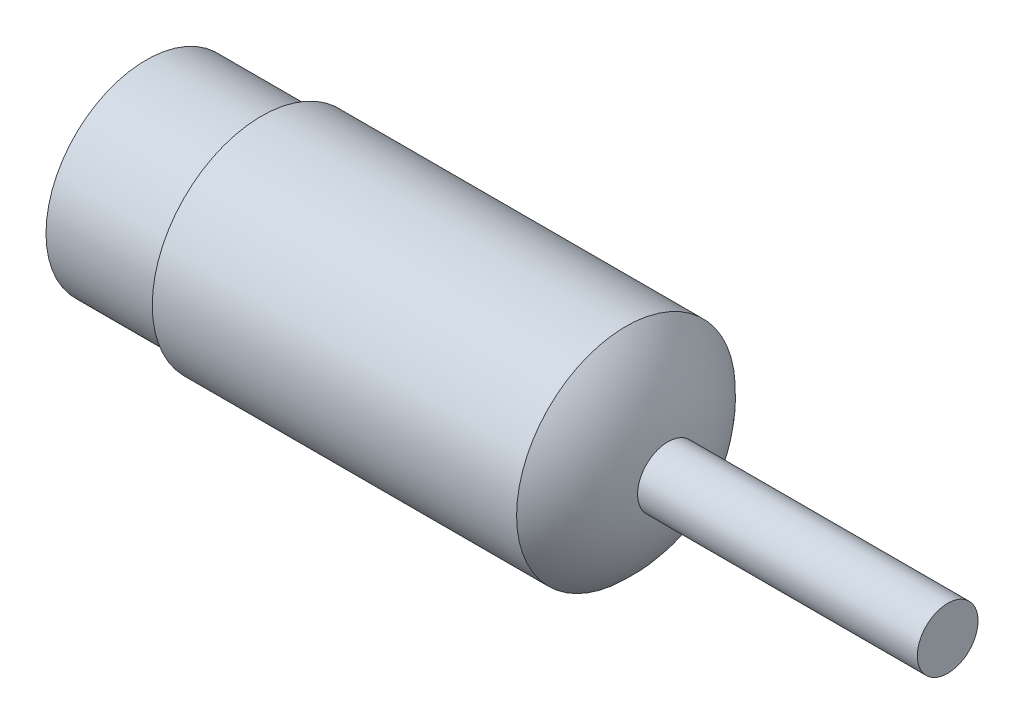
ISO-10303-21;
HEADER;
FILE_DESCRIPTION(('STEP AP214'),'2;1');
FILE_NAME('part.step','',(''),(''),'','','');
FILE_SCHEMA(('AUTOMOTIVE_DESIGN { 1 0 10303 214 1 1 1 1 }'));
ENDSEC;
DATA;
#1=APPLICATION_CONTEXT('core data for automotive mechanical design processes');
#2=APPLICATION_PROTOCOL_DEFINITION('international standard','automotive_design',2000,#1);
#3=PRODUCT_CONTEXT('',#1,'mechanical');
#4=PRODUCT('Part','Part','',(#3));
#5=PRODUCT_RELATED_PRODUCT_CATEGORY('part','',(#4));
#6=PRODUCT_DEFINITION_FORMATION('','',#4);
#7=PRODUCT_DEFINITION_CONTEXT('part definition',#1,'design');
#8=PRODUCT_DEFINITION('design','',#6,#7);
#9=PRODUCT_DEFINITION_SHAPE('','',#8);
#10=(LENGTH_UNIT() NAMED_UNIT(*) SI_UNIT(.MILLI.,.METRE.));
#11=(NAMED_UNIT(*) PLANE_ANGLE_UNIT() SI_UNIT($,.RADIAN.));
#12=(NAMED_UNIT(*) SI_UNIT($,.STERADIAN.) SOLID_ANGLE_UNIT());
#13=UNCERTAINTY_MEASURE_WITH_UNIT(LENGTH_MEASURE(1.E-05),#10,'distance_accuracy_value','');
#14=(GEOMETRIC_REPRESENTATION_CONTEXT(3) GLOBAL_UNCERTAINTY_ASSIGNED_CONTEXT((#13)) GLOBAL_UNIT_ASSIGNED_CONTEXT((#10,
#11,#12)) REPRESENTATION_CONTEXT('',''));
#15=CARTESIAN_POINT('',(0.,0.,0.));
#16=DIRECTION('',(0.,0.,1.));
#17=DIRECTION('',(1.,0.,0.));
#18=AXIS2_PLACEMENT_3D('',#15,#16,#17);
#19=CARTESIAN_POINT('',(0.,0.,0.));
#20=DIRECTION('',(1.,0.,0.));
#21=DIRECTION('',(0.,0.,-1.));
#22=AXIS2_PLACEMENT_3D('',#19,#20,#21);
#23=PLANE('',#22);
#24=CARTESIAN_POINT('',(0.,0.,0.));
#25=DIRECTION('',(-1.,0.,0.));
#26=DIRECTION('',(0.,0.,1.));
#27=AXIS2_PLACEMENT_3D('',#24,#25,#26);
#28=CIRCLE('',#27,8.25);
#29=CARTESIAN_POINT('',(0.,0.,8.25));
#30=VERTEX_POINT('',#29);
#31=EDGE_CURVE('E10',#30,#30,#28,.T.);
#32=ORIENTED_EDGE('',*,*,#31,.T.);
#33=EDGE_LOOP('',(#32));
#34=FACE_BOUND('',#33,.T.);
#35=ADVANCED_FACE('F33',(#34),#23,.F.);
#36=CARTESIAN_POINT('',(0.,0.,0.));
#37=DIRECTION('',(-1.,0.,0.));
#38=DIRECTION('',(0.,0.,1.));
#39=AXIS2_PLACEMENT_3D('',#36,#37,#38);
#40=CYLINDRICAL_SURFACE('',#39,8.25);
#41=ORIENTED_EDGE('',*,*,#31,.F.);
#42=EDGE_LOOP('',(#41));
#43=FACE_BOUND('',#42,.T.);
#44=CARTESIAN_POINT('',(9.5,0.,0.));
#45=DIRECTION('',(-1.,0.,0.));
#46=DIRECTION('',(0.,0.,1.));
#47=AXIS2_PLACEMENT_3D('',#44,#45,#46);
#48=CIRCLE('',#47,8.25);
#49=CARTESIAN_POINT('',(9.5,0.,8.25));
#50=VERTEX_POINT('',#49);
#51=EDGE_CURVE('E40',#50,#50,#48,.T.);
#52=ORIENTED_EDGE('',*,*,#51,.T.);
#53=EDGE_LOOP('',(#52));
#54=FACE_BOUND('',#53,.T.);
#55=ADVANCED_FACE('F75',(#43,#54),#40,.T.);
#56=CARTESIAN_POINT('',(9.5,8.25,0.));
#57=DIRECTION('',(1.,0.,0.));
#58=DIRECTION('',(0.,0.,-1.));
#59=AXIS2_PLACEMENT_3D('',#56,#57,#58);
#60=PLANE('',#59);
#61=ORIENTED_EDGE('',*,*,#51,.F.);
#62=EDGE_LOOP('',(#61));
#63=FACE_BOUND('',#62,.T.);
#64=CARTESIAN_POINT('',(9.5,0.,0.));
#65=DIRECTION('',(-1.,0.,0.));
#66=DIRECTION('',(0.,0.,1.));
#67=AXIS2_PLACEMENT_3D('',#64,#65,#66);
#68=CIRCLE('',#67,9.);
#69=CARTESIAN_POINT('',(9.5,0.,9.));
#70=VERTEX_POINT('',#69);
#71=EDGE_CURVE('E44',#70,#70,#68,.T.);
#72=ORIENTED_EDGE('',*,*,#71,.T.);
#73=EDGE_LOOP('',(#72));
#74=FACE_BOUND('',#73,.T.);
#75=ADVANCED_FACE('F79',(#63,#74),#60,.F.);
#76=CARTESIAN_POINT('',(0.,0.,0.));
#77=DIRECTION('',(-1.,0.,0.));
#78=DIRECTION('',(0.,0.,1.));
#79=AXIS2_PLACEMENT_3D('',#76,#77,#78);
#80=CYLINDRICAL_SURFACE('',#79,9.);
#81=ORIENTED_EDGE('',*,*,#71,.F.);
#82=EDGE_LOOP('',(#81));
#83=FACE_BOUND('',#82,.T.);
#84=CARTESIAN_POINT('',(39.5,0.,0.));
#85=DIRECTION('',(-1.,0.,0.));
#86=DIRECTION('',(0.,0.,1.));
#87=AXIS2_PLACEMENT_3D('',#84,#85,#86);
#88=CIRCLE('',#87,9.);
#89=CARTESIAN_POINT('',(39.5,0.,9.));
#90=VERTEX_POINT('',#89);
#91=EDGE_CURVE('E49',#90,#90,#88,.T.);
#92=ORIENTED_EDGE('',*,*,#91,.T.);
#93=EDGE_LOOP('',(#92));
#94=FACE_BOUND('',#93,.T.);
#95=ADVANCED_FACE('F72',(#83,#94),#80,.T.);
#96=CARTESIAN_POINT('',(32.491464953089,0.,0.));
#97=DIRECTION('',(-1.,0.,0.));
#98=DIRECTION('',(0.,0.,1.));
#99=AXIS2_PLACEMENT_3D('',#96,#97,#98);
#100=DEGENERATE_TOROIDAL_SURFACE('',#99,1.09390303731238,10.5653174437496,.T.);
#101=CARTESIAN_POINT('',(42.9627983934259,0.,0.));
#102=DIRECTION('',(-1.,0.,0.));
#103=DIRECTION('',(0.,0.,1.));
#104=AXIS2_PLACEMENT_3D('',#101,#102,#103);
#105=CIRCLE('',#104,2.5);
#106=CARTESIAN_POINT('',(42.9627983934259,0.,2.5));
#107=VERTEX_POINT('',#106);
#108=EDGE_CURVE('E36',#107,#107,#105,.T.);
#109=ORIENTED_EDGE('',*,*,#108,.T.);
#110=EDGE_LOOP('',(#109));
#111=FACE_BOUND('',#110,.T.);
#112=ORIENTED_EDGE('',*,*,#91,.F.);
#113=EDGE_LOOP('',(#112));
#114=FACE_BOUND('',#113,.T.);
#115=ADVANCED_FACE('F59',(#111,#114),#100,.T.);
#116=CARTESIAN_POINT('',(66.,0.,0.));
#117=DIRECTION('',(-1.,0.,0.));
#118=DIRECTION('',(0.,0.,1.));
#119=AXIS2_PLACEMENT_3D('',#116,#117,#118);
#120=CYLINDRICAL_SURFACE('',#119,2.5);
#121=CARTESIAN_POINT('',(66.,0.,0.));
#122=DIRECTION('',(-1.,0.,0.));
#123=DIRECTION('',(0.,0.,1.));
#124=AXIS2_PLACEMENT_3D('',#121,#122,#123);
#125=CIRCLE('',#124,2.5);
#126=CARTESIAN_POINT('',(66.,0.,2.5));
#127=VERTEX_POINT('',#126);
#128=EDGE_CURVE('E52',#127,#127,#125,.T.);
#129=ORIENTED_EDGE('',*,*,#128,.T.);
#130=EDGE_LOOP('',(#129));
#131=FACE_BOUND('',#130,.T.);
#132=ORIENTED_EDGE('',*,*,#108,.F.);
#133=EDGE_LOOP('',(#132));
#134=FACE_BOUND('',#133,.T.);
#135=ADVANCED_FACE('F62',(#131,#134),#120,.T.);
#136=CARTESIAN_POINT('',(66.,0.,0.));
#137=DIRECTION('',(-1.,0.,0.));
#138=DIRECTION('',(0.,0.,1.));
#139=AXIS2_PLACEMENT_3D('',#136,#137,#138);
#140=PLANE('',#139);
#141=ORIENTED_EDGE('',*,*,#128,.F.);
#142=EDGE_LOOP('',(#141));
#143=FACE_BOUND('',#142,.T.);
#144=ADVANCED_FACE('F64',(#143),#140,.F.);
#145=CLOSED_SHELL('',(#35,#55,#75,#95,#115,#135,#144));
#146=MANIFOLD_SOLID_BREP('B2',#145);
#147=ADVANCED_BREP_SHAPE_REPRESENTATION('',(#18,#146),#14);
#148=SHAPE_DEFINITION_REPRESENTATION(#9,#147);
ENDSEC;
END-ISO-10303-21;
